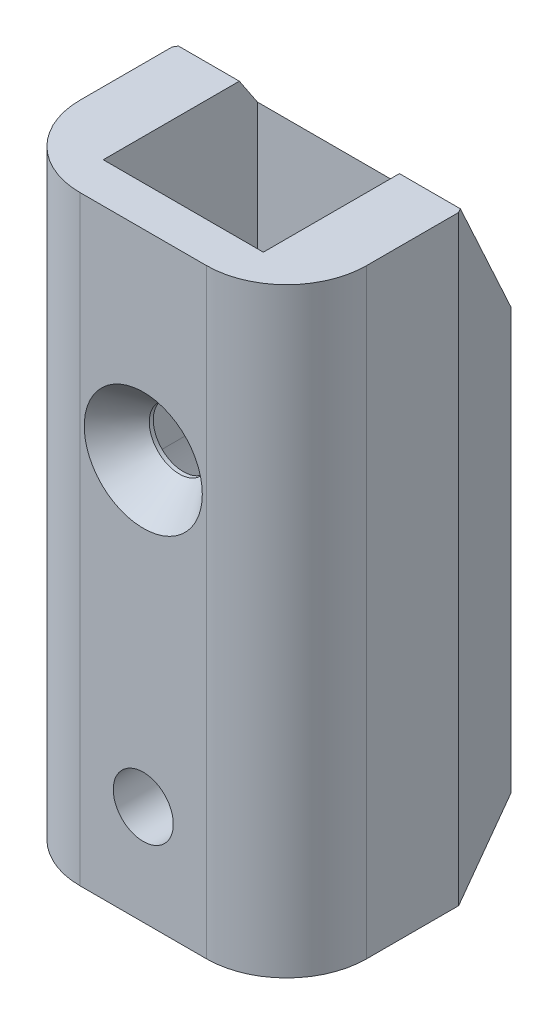
ISO-10303-21;
HEADER;
FILE_DESCRIPTION(('STEP AP214'),'2;1');
FILE_NAME('part.step','',(''),(''),'','','');
FILE_SCHEMA(('AUTOMOTIVE_DESIGN { 1 0 10303 214 1 1 1 1 }'));
ENDSEC;
DATA;
#1=APPLICATION_CONTEXT('core data for automotive mechanical design processes');
#2=APPLICATION_PROTOCOL_DEFINITION('international standard','automotive_design',2000,#1);
#3=PRODUCT_CONTEXT('',#1,'mechanical');
#4=PRODUCT('Part','Part','',(#3));
#5=PRODUCT_RELATED_PRODUCT_CATEGORY('part','',(#4));
#6=PRODUCT_DEFINITION_FORMATION('','',#4);
#7=PRODUCT_DEFINITION_CONTEXT('part definition',#1,'design');
#8=PRODUCT_DEFINITION('design','',#6,#7);
#9=PRODUCT_DEFINITION_SHAPE('','',#8);
#10=(LENGTH_UNIT() NAMED_UNIT(*) SI_UNIT(.MILLI.,.METRE.));
#11=(NAMED_UNIT(*) PLANE_ANGLE_UNIT() SI_UNIT($,.RADIAN.));
#12=(NAMED_UNIT(*) SI_UNIT($,.STERADIAN.) SOLID_ANGLE_UNIT());
#13=UNCERTAINTY_MEASURE_WITH_UNIT(LENGTH_MEASURE(1.E-05),#10,'distance_accuracy_value','');
#14=(GEOMETRIC_REPRESENTATION_CONTEXT(3) GLOBAL_UNCERTAINTY_ASSIGNED_CONTEXT((#13)) GLOBAL_UNIT_ASSIGNED_CONTEXT((#10,
#11,#12)) REPRESENTATION_CONTEXT('',''));
#15=CARTESIAN_POINT('',(0.,0.,0.));
#16=DIRECTION('',(0.,0.,1.));
#17=DIRECTION('',(1.,0.,0.));
#18=AXIS2_PLACEMENT_3D('',#15,#16,#17);
#19=CARTESIAN_POINT('',(3.57957166897568,-10.,-6.2));
#20=DIRECTION('',(0.,0.,-1.));
#21=DIRECTION('',(-1.,0.,0.));
#22=AXIS2_PLACEMENT_3D('',#19,#20,#21);
#23=PLANE('',#22);
#24=CARTESIAN_POINT('',(0.,6.,-6.2));
#25=DIRECTION('',(0.,0.,-1.));
#26=DIRECTION('',(-1.,0.,0.));
#27=AXIS2_PLACEMENT_3D('',#24,#25,#26);
#28=CIRCLE('',#27,3.29999999999999);
#29=CARTESIAN_POINT('',(-3.29999999999999,6.,-6.2));
#30=VERTEX_POINT('',#29);
#31=EDGE_CURVE('E302',#30,#30,#28,.F.);
#32=ORIENTED_EDGE('',*,*,#31,.T.);
#33=EDGE_LOOP('',(#32));
#34=FACE_BOUND('',#33,.T.);
#35=CARTESIAN_POINT('',(0.,-5.,-6.2));
#36=DIRECTION('',(0.,0.,-1.));
#37=DIRECTION('',(-1.,0.,0.));
#38=AXIS2_PLACEMENT_3D('',#35,#36,#37);
#39=CIRCLE('',#38,1.5);
#40=CARTESIAN_POINT('',(-1.5,-5.,-6.2));
#41=VERTEX_POINT('',#40);
#42=EDGE_CURVE('E344',#41,#41,#39,.T.);
#43=ORIENTED_EDGE('',*,*,#42,.F.);
#44=EDGE_LOOP('',(#43));
#45=FACE_BOUND('',#44,.T.);
#46=DIRECTION('',(0.,1.,0.));
#47=VECTOR('',#46,1.);
#48=CARTESIAN_POINT('',(-3.57957166897568,-10.,-6.2));
#49=LINE('',#48,#47);
#50=CARTESIAN_POINT('',(-3.57957166897568,-10.,-6.2));
#51=VERTEX_POINT('',#50);
#52=CARTESIAN_POINT('',(-3.57957166897567,11.,-6.2));
#53=VERTEX_POINT('',#52);
#54=EDGE_CURVE('E292',#51,#53,#49,.T.);
#55=ORIENTED_EDGE('',*,*,#54,.T.);
#56=DIRECTION('',(-1.,0.,0.));
#57=VECTOR('',#56,1.);
#58=CARTESIAN_POINT('',(7.15914333795136,11.,-6.2));
#59=LINE('',#58,#57);
#60=CARTESIAN_POINT('',(3.57957166897568,11.,-6.2));
#61=VERTEX_POINT('',#60);
#62=EDGE_CURVE('E338',#61,#53,#59,.T.);
#63=ORIENTED_EDGE('',*,*,#62,.F.);
#64=DIRECTION('',(0.,1.,0.));
#65=VECTOR('',#64,1.);
#66=CARTESIAN_POINT('',(3.57957166897568,-10.,-6.2));
#67=LINE('',#66,#65);
#68=CARTESIAN_POINT('',(3.57957166897568,-10.,-6.2));
#69=VERTEX_POINT('',#68);
#70=EDGE_CURVE('E182',#69,#61,#67,.T.);
#71=ORIENTED_EDGE('',*,*,#70,.F.);
#72=DIRECTION('',(-1.,0.,0.));
#73=VECTOR('',#72,1.);
#74=CARTESIAN_POINT('',(3.57957166897568,-10.,-6.2));
#75=LINE('',#74,#73);
#76=EDGE_CURVE('E281',#69,#51,#75,.T.);
#77=ORIENTED_EDGE('',*,*,#76,.T.);
#78=EDGE_LOOP('',(#55,#63,#71,#77));
#79=FACE_BOUND('',#78,.T.);
#80=ADVANCED_FACE('F39',(#34,#45,#79),#23,.T.);
#81=CARTESIAN_POINT('',(0.,20.,33.1970187895471));
#82=DIRECTION('',(0.,-1.,0.));
#83=DIRECTION('',(0.,0.,-1.));
#84=AXIS2_PLACEMENT_3D('',#81,#82,#83);
#85=PLANE('',#84);
#86=DIRECTION('',(-1.,0.,0.));
#87=VECTOR('',#86,1.);
#88=CARTESIAN_POINT('',(7.15914333795136,20.,-0.199999999999981));
#89=LINE('',#88,#87);
#90=CARTESIAN_POINT('',(-4.,20.,-0.199999999999981));
#91=VERTEX_POINT('',#90);
#92=CARTESIAN_POINT('',(-7.04367328411344,20.,-0.19999999999998));
#93=VERTEX_POINT('',#92);
#94=EDGE_CURVE('E173',#91,#93,#89,.T.);
#95=ORIENTED_EDGE('',*,*,#94,.T.);
#96=DIRECTION('',(0.500000000000001,0.,-0.866025403784438));
#97=VECTOR('',#96,1.);
#98=CARTESIAN_POINT('',(-5.36935750346351,20.,-3.1));
#99=LINE('',#98,#97);
#100=CARTESIAN_POINT('',(-7.15914333795136,20.,0.));
#101=VERTEX_POINT('',#100);
#102=EDGE_CURVE('E190',#101,#93,#99,.T.);
#103=ORIENTED_EDGE('',*,*,#102,.F.);
#104=DIRECTION('',(0.,0.,-1.));
#105=VECTOR('',#104,1.);
#106=CARTESIAN_POINT('',(-7.15914333795136,20.,33.1970187895471));
#107=LINE('',#106,#105);
#108=CARTESIAN_POINT('',(-7.15914333795136,20.,4.6));
#109=VERTEX_POINT('',#108);
#110=EDGE_CURVE('E267',#109,#101,#107,.T.);
#111=ORIENTED_EDGE('',*,*,#110,.F.);
#112=CARTESIAN_POINT('',(-3.15914333795136,20.,4.6));
#113=DIRECTION('',(0.,-1.,0.));
#114=DIRECTION('',(0.,0.,-1.));
#115=AXIS2_PLACEMENT_3D('',#112,#113,#114);
#116=CIRCLE('',#115,4.);
#117=CARTESIAN_POINT('',(-3.15914333795136,20.,8.6));
#118=VERTEX_POINT('',#117);
#119=EDGE_CURVE('E313',#109,#118,#116,.F.);
#120=ORIENTED_EDGE('',*,*,#119,.T.);
#121=DIRECTION('',(-1.,0.,0.));
#122=VECTOR('',#121,1.);
#123=CARTESIAN_POINT('',(0.,20.,8.6));
#124=LINE('',#123,#122);
#125=CARTESIAN_POINT('',(3.15914333795136,20.,8.6));
#126=VERTEX_POINT('',#125);
#127=EDGE_CURVE('E256',#126,#118,#124,.T.);
#128=ORIENTED_EDGE('',*,*,#127,.F.);
#129=CARTESIAN_POINT('',(3.15914333795136,20.,4.6));
#130=DIRECTION('',(0.,-1.,0.));
#131=DIRECTION('',(0.,0.,-1.));
#132=AXIS2_PLACEMENT_3D('',#129,#130,#131);
#133=CIRCLE('',#132,4.);
#134=CARTESIAN_POINT('',(7.15914333795136,20.,4.6));
#135=VERTEX_POINT('',#134);
#136=EDGE_CURVE('E315',#126,#135,#133,.F.);
#137=ORIENTED_EDGE('',*,*,#136,.T.);
#138=DIRECTION('',(0.,0.,-1.));
#139=VECTOR('',#138,1.);
#140=CARTESIAN_POINT('',(7.15914333795136,20.,33.1970187895471));
#141=LINE('',#140,#139);
#142=CARTESIAN_POINT('',(7.15914333795136,20.,0.));
#143=VERTEX_POINT('',#142);
#144=EDGE_CURVE('E188',#135,#143,#141,.T.);
#145=ORIENTED_EDGE('',*,*,#144,.T.);
#146=DIRECTION('',(0.499999999999995,0.,0.866025403784442));
#147=VECTOR('',#146,1.);
#148=CARTESIAN_POINT('',(5.36935750346353,20.,-3.09999999999997));
#149=LINE('',#148,#147);
#150=CARTESIAN_POINT('',(7.04367328411344,20.,-0.199999999999982));
#151=VERTEX_POINT('',#150);
#152=EDGE_CURVE('E179',#151,#143,#149,.T.);
#153=ORIENTED_EDGE('',*,*,#152,.F.);
#154=CARTESIAN_POINT('',(4.,20.,-0.199999999999981));
#155=VERTEX_POINT('',#154);
#156=EDGE_CURVE('E162',#151,#155,#89,.T.);
#157=ORIENTED_EDGE('',*,*,#156,.T.);
#158=DIRECTION('',(0.,0.,-1.));
#159=VECTOR('',#158,1.);
#160=CARTESIAN_POINT('',(4.,20.,33.1970187895471));
#161=LINE('',#160,#159);
#162=CARTESIAN_POINT('',(4.,20.,6.6));
#163=VERTEX_POINT('',#162);
#164=EDGE_CURVE('E259',#163,#155,#161,.T.);
#165=ORIENTED_EDGE('',*,*,#164,.F.);
#166=DIRECTION('',(1.,0.,0.));
#167=VECTOR('',#166,1.);
#168=CARTESIAN_POINT('',(0.,20.,6.6));
#169=LINE('',#168,#167);
#170=CARTESIAN_POINT('',(-4.,20.,6.6));
#171=VERTEX_POINT('',#170);
#172=EDGE_CURVE('E250',#171,#163,#169,.T.);
#173=ORIENTED_EDGE('',*,*,#172,.F.);
#174=DIRECTION('',(0.,0.,-1.));
#175=VECTOR('',#174,1.);
#176=CARTESIAN_POINT('',(-4.,20.,33.1970187895471));
#177=LINE('',#176,#175);
#178=EDGE_CURVE('E264',#171,#91,#177,.T.);
#179=ORIENTED_EDGE('',*,*,#178,.T.);
#180=EDGE_LOOP('',(#95,#103,#111,#120,#128,#137,#145,#153,#157,#165,#173,#179));
#181=FACE_BOUND('',#180,.T.);
#182=ADVANCED_FACE('F186',(#181),#85,.F.);
#183=CARTESIAN_POINT('',(-4.,0.,33.1970187895471));
#184=DIRECTION('',(-1.,0.,0.));
#185=DIRECTION('',(0.,0.,1.));
#186=AXIS2_PLACEMENT_3D('',#183,#184,#185);
#187=PLANE('',#186);
#188=DIRECTION('',(0.,-0.832050294337843,-0.55470019622523));
#189=VECTOR('',#188,1.);
#190=CARTESIAN_POINT('',(-4.,21.5678548259449,0.84523655062993));
#191=LINE('',#190,#189);
#192=CARTESIAN_POINT('',(-4.,18.65,-1.1));
#193=VERTEX_POINT('',#192);
#194=EDGE_CURVE('E54',#91,#193,#191,.T.);
#195=ORIENTED_EDGE('',*,*,#194,.F.);
#196=ORIENTED_EDGE('',*,*,#178,.F.);
#197=DIRECTION('',(0.,1.,0.));
#198=VECTOR('',#197,1.);
#199=CARTESIAN_POINT('',(-4.,0.,6.6));
#200=LINE('',#199,#198);
#201=CARTESIAN_POINT('',(-4.,6.,6.6));
#202=VERTEX_POINT('',#201);
#203=EDGE_CURVE('E243',#202,#171,#200,.T.);
#204=ORIENTED_EDGE('',*,*,#203,.F.);
#205=DIRECTION('',(0.,0.,-1.));
#206=VECTOR('',#205,1.);
#207=CARTESIAN_POINT('',(-4.,6.,33.1970187895471));
#208=LINE('',#207,#206);
#209=CARTESIAN_POINT('',(-4.,6.,-1.1));
#210=VERTEX_POINT('',#209);
#211=EDGE_CURVE('E260',#202,#210,#208,.T.);
#212=ORIENTED_EDGE('',*,*,#211,.T.);
#213=DIRECTION('',(0.,1.,0.));
#214=VECTOR('',#213,1.);
#215=CARTESIAN_POINT('',(-4.,0.,-1.1));
#216=LINE('',#215,#214);
#217=EDGE_CURVE('E212',#210,#193,#216,.T.);
#218=ORIENTED_EDGE('',*,*,#217,.T.);
#219=EDGE_LOOP('',(#195,#196,#204,#212,#218));
#220=FACE_BOUND('',#219,.T.);
#221=ADVANCED_FACE('F416',(#220),#187,.F.);
#222=CARTESIAN_POINT('',(4.,0.,33.1970187895471));
#223=DIRECTION('',(-1.,0.,0.));
#224=DIRECTION('',(0.,0.,1.));
#225=AXIS2_PLACEMENT_3D('',#222,#223,#224);
#226=PLANE('',#225);
#227=ORIENTED_EDGE('',*,*,#164,.T.);
#228=DIRECTION('',(0.,-0.832050294337843,-0.55470019622523));
#229=VECTOR('',#228,1.);
#230=CARTESIAN_POINT('',(4.,21.5678548259449,0.84523655062993));
#231=LINE('',#230,#229);
#232=CARTESIAN_POINT('',(4.,18.65,-1.1));
#233=VERTEX_POINT('',#232);
#234=EDGE_CURVE('E168',#155,#233,#231,.T.);
#235=ORIENTED_EDGE('',*,*,#234,.T.);
#236=DIRECTION('',(0.,1.,0.));
#237=VECTOR('',#236,1.);
#238=CARTESIAN_POINT('',(4.,0.,-1.1));
#239=LINE('',#238,#237);
#240=CARTESIAN_POINT('',(4.,6.,-1.1));
#241=VERTEX_POINT('',#240);
#242=EDGE_CURVE('E217',#241,#233,#239,.T.);
#243=ORIENTED_EDGE('',*,*,#242,.F.);
#244=DIRECTION('',(0.,0.,-1.));
#245=VECTOR('',#244,1.);
#246=CARTESIAN_POINT('',(4.,6.,33.1970187895471));
#247=LINE('',#246,#245);
#248=CARTESIAN_POINT('',(4.,6.,6.6));
#249=VERTEX_POINT('',#248);
#250=EDGE_CURVE('E263',#249,#241,#247,.T.);
#251=ORIENTED_EDGE('',*,*,#250,.F.);
#252=DIRECTION('',(0.,1.,0.));
#253=VECTOR('',#252,1.);
#254=CARTESIAN_POINT('',(4.,0.,6.6));
#255=LINE('',#254,#253);
#256=EDGE_CURVE('E248',#249,#163,#255,.T.);
#257=ORIENTED_EDGE('',*,*,#256,.T.);
#258=EDGE_LOOP('',(#227,#235,#243,#251,#257));
#259=FACE_BOUND('',#258,.T.);
#260=ADVANCED_FACE('F419',(#259),#226,.T.);
#261=CARTESIAN_POINT('',(-3.57957166897568,-10.,-6.2));
#262=DIRECTION('',(-0.866025403784439,0.,-0.5));
#263=DIRECTION('',(-0.5,0.,0.866025403784439));
#264=AXIS2_PLACEMENT_3D('',#261,#262,#263);
#265=PLANE('',#264);
#266=ORIENTED_EDGE('',*,*,#102,.T.);
#267=DIRECTION('',(0.30499714066521,-0.792405815693061,-0.528270543795375));
#268=VECTOR('',#267,1.);
#269=CARTESIAN_POINT('',(1.49573999971453,-2.18604651162787,-14.9906976744186));
#270=LINE('',#269,#268);
#271=EDGE_CURVE('E183',#93,#53,#270,.T.);
#272=ORIENTED_EDGE('',*,*,#271,.T.);
#273=ORIENTED_EDGE('',*,*,#54,.F.);
#274=DIRECTION('',(-0.5,0.,0.866025403784438));
#275=VECTOR('',#274,1.);
#276=CARTESIAN_POINT('',(-3.57957166897568,-10.,-6.2));
#277=LINE('',#276,#275);
#278=CARTESIAN_POINT('',(-7.15914333795136,-10.,0.));
#279=VERTEX_POINT('',#278);
#280=EDGE_CURVE('E284',#51,#279,#277,.T.);
#281=ORIENTED_EDGE('',*,*,#280,.T.);
#282=DIRECTION('',(0.,1.,0.));
#283=VECTOR('',#282,1.);
#284=CARTESIAN_POINT('',(-7.15914333795136,-10.,0.));
#285=LINE('',#284,#283);
#286=EDGE_CURVE('E288',#279,#101,#285,.T.);
#287=ORIENTED_EDGE('',*,*,#286,.T.);
#288=EDGE_LOOP('',(#266,#272,#273,#281,#287));
#289=FACE_BOUND('',#288,.T.);
#290=ADVANCED_FACE('F332',(#289),#265,.T.);
#291=CARTESIAN_POINT('',(7.15914333795136,-10.,0.));
#292=DIRECTION('',(0.866025403784439,0.,-0.5));
#293=DIRECTION('',(-0.5,0.,-0.866025403784439));
#294=AXIS2_PLACEMENT_3D('',#291,#292,#293);
#295=PLANE('',#294);
#296=ORIENTED_EDGE('',*,*,#70,.T.);
#297=DIRECTION('',(0.30499714066521,0.792405815693061,0.528270543795375));
#298=VECTOR('',#297,1.);
#299=CARTESIAN_POINT('',(-0.163806355444502,1.2744186046512,-12.6837209302326));
#300=LINE('',#299,#298);
#301=EDGE_CURVE('E165',#61,#151,#300,.T.);
#302=ORIENTED_EDGE('',*,*,#301,.T.);
#303=ORIENTED_EDGE('',*,*,#152,.T.);
#304=DIRECTION('',(0.,1.,0.));
#305=VECTOR('',#304,1.);
#306=CARTESIAN_POINT('',(7.15914333795136,-10.,0.));
#307=LINE('',#306,#305);
#308=CARTESIAN_POINT('',(7.15914333795136,-10.,0.));
#309=VERTEX_POINT('',#308);
#310=EDGE_CURVE('E287',#309,#143,#307,.T.);
#311=ORIENTED_EDGE('',*,*,#310,.F.);
#312=DIRECTION('',(-0.5,0.,-0.866025403784439));
#313=VECTOR('',#312,1.);
#314=CARTESIAN_POINT('',(7.15914333795136,-10.,0.));
#315=LINE('',#314,#313);
#316=EDGE_CURVE('E277',#309,#69,#315,.T.);
#317=ORIENTED_EDGE('',*,*,#316,.T.);
#318=EDGE_LOOP('',(#296,#302,#303,#311,#317));
#319=FACE_BOUND('',#318,.T.);
#320=ADVANCED_FACE('F177',(#319),#295,.T.);
#321=CARTESIAN_POINT('',(0.,0.,-1.1));
#322=DIRECTION('',(0.,0.,1.));
#323=DIRECTION('',(1.,0.,0.));
#324=AXIS2_PLACEMENT_3D('',#321,#322,#323);
#325=PLANE('',#324);
#326=CARTESIAN_POINT('',(0.,10.,-1.1));
#327=DIRECTION('',(0.,0.,1.));
#328=DIRECTION('',(1.,0.,0.));
#329=AXIS2_PLACEMENT_3D('',#326,#327,#328);
#330=CIRCLE('',#329,3.2);
#331=CARTESIAN_POINT('',(3.2,10.,-1.1));
#332=VERTEX_POINT('',#331);
#333=CARTESIAN_POINT('',(-3.2,10.,-1.1));
#334=VERTEX_POINT('',#333);
#335=EDGE_CURVE('E194',#332,#334,#330,.T.);
#336=ORIENTED_EDGE('',*,*,#335,.F.);
#337=DIRECTION('',(0.,1.,0.));
#338=VECTOR('',#337,1.);
#339=CARTESIAN_POINT('',(3.2,0.,-1.1));
#340=LINE('',#339,#338);
#341=CARTESIAN_POINT('',(3.2,6.,-1.1));
#342=VERTEX_POINT('',#341);
#343=EDGE_CURVE('E203',#342,#332,#340,.T.);
#344=ORIENTED_EDGE('',*,*,#343,.F.);
#345=CARTESIAN_POINT('',(0.,6.,-1.1));
#346=DIRECTION('',(0.,0.,1.));
#347=DIRECTION('',(1.,0.,0.));
#348=AXIS2_PLACEMENT_3D('',#345,#346,#347);
#349=CIRCLE('',#348,3.2);
#350=CARTESIAN_POINT('',(-3.2,6.,-1.1));
#351=VERTEX_POINT('',#350);
#352=EDGE_CURVE('E206',#351,#342,#349,.T.);
#353=ORIENTED_EDGE('',*,*,#352,.F.);
#354=DIRECTION('',(0.,1.,0.));
#355=VECTOR('',#354,1.);
#356=CARTESIAN_POINT('',(-3.2,0.,-1.1));
#357=LINE('',#356,#355);
#358=EDGE_CURVE('E209',#351,#334,#357,.T.);
#359=ORIENTED_EDGE('',*,*,#358,.T.);
#360=EDGE_LOOP('',(#336,#344,#353,#359));
#361=FACE_BOUND('',#360,.T.);
#362=ORIENTED_EDGE('',*,*,#242,.T.);
#363=DIRECTION('',(-1.,0.,0.));
#364=VECTOR('',#363,1.);
#365=CARTESIAN_POINT('',(0.,18.65,-1.1));
#366=LINE('',#365,#364);
#367=EDGE_CURVE('E11',#233,#193,#366,.T.);
#368=ORIENTED_EDGE('',*,*,#367,.T.);
#369=ORIENTED_EDGE('',*,*,#217,.F.);
#370=CARTESIAN_POINT('',(0.,6.,-1.1));
#371=DIRECTION('',(0.,0.,1.));
#372=DIRECTION('',(1.,0.,0.));
#373=AXIS2_PLACEMENT_3D('',#370,#371,#372);
#374=CIRCLE('',#373,4.);
#375=EDGE_CURVE('E215',#210,#241,#374,.T.);
#376=ORIENTED_EDGE('',*,*,#375,.T.);
#377=EDGE_LOOP('',(#362,#368,#369,#376));
#378=FACE_BOUND('',#377,.T.);
#379=ADVANCED_FACE('F374',(#361,#378),#325,.T.);
#380=CARTESIAN_POINT('',(-7.15914333795136,0.,33.1970187895471));
#381=DIRECTION('',(-1.,0.,0.));
#382=DIRECTION('',(0.,0.,1.));
#383=AXIS2_PLACEMENT_3D('',#380,#381,#382);
#384=PLANE('',#383);
#385=DIRECTION('',(0.,0.,-1.));
#386=VECTOR('',#385,1.);
#387=CARTESIAN_POINT('',(-7.15914333795136,-10.,0.));
#388=LINE('',#387,#386);
#389=CARTESIAN_POINT('',(-7.15914333795136,-10.,4.6));
#390=VERTEX_POINT('',#389);
#391=EDGE_CURVE('E197',#390,#279,#388,.T.);
#392=ORIENTED_EDGE('',*,*,#391,.F.);
#393=DIRECTION('',(0.,1.,0.));
#394=VECTOR('',#393,1.);
#395=CARTESIAN_POINT('',(-7.15914333795136,0.,4.6));
#396=LINE('',#395,#394);
#397=EDGE_CURVE('E47',#390,#109,#396,.T.);
#398=ORIENTED_EDGE('',*,*,#397,.T.);
#399=ORIENTED_EDGE('',*,*,#110,.T.);
#400=ORIENTED_EDGE('',*,*,#286,.F.);
#401=EDGE_LOOP('',(#392,#398,#399,#400));
#402=FACE_BOUND('',#401,.T.);
#403=ADVANCED_FACE('F325',(#402),#384,.T.);
#404=CARTESIAN_POINT('',(7.15914333795136,0.,33.1970187895471));
#405=DIRECTION('',(-1.,0.,0.));
#406=DIRECTION('',(0.,0.,1.));
#407=AXIS2_PLACEMENT_3D('',#404,#405,#406);
#408=PLANE('',#407);
#409=ORIENTED_EDGE('',*,*,#144,.F.);
#410=DIRECTION('',(0.,1.,0.));
#411=VECTOR('',#410,1.);
#412=CARTESIAN_POINT('',(7.15914333795136,-10.,4.6));
#413=LINE('',#412,#411);
#414=CARTESIAN_POINT('',(7.15914333795136,-10.,4.6));
#415=VERTEX_POINT('',#414);
#416=EDGE_CURVE('E317',#135,#415,#413,.F.);
#417=ORIENTED_EDGE('',*,*,#416,.T.);
#418=DIRECTION('',(0.,0.,1.));
#419=VECTOR('',#418,1.);
#420=CARTESIAN_POINT('',(7.15914333795136,-10.,0.));
#421=LINE('',#420,#419);
#422=EDGE_CURVE('E191',#309,#415,#421,.T.);
#423=ORIENTED_EDGE('',*,*,#422,.F.);
#424=ORIENTED_EDGE('',*,*,#310,.T.);
#425=EDGE_LOOP('',(#409,#417,#423,#424));
#426=FACE_BOUND('',#425,.T.);
#427=ADVANCED_FACE('F414',(#426),#408,.F.);
#428=CARTESIAN_POINT('',(0.,6.,33.1970187895471));
#429=DIRECTION('',(0.,0.,-1.));
#430=DIRECTION('',(-1.,0.,0.));
#431=AXIS2_PLACEMENT_3D('',#428,#429,#430);
#432=CYLINDRICAL_SURFACE('',#431,4.);
#433=ORIENTED_EDGE('',*,*,#375,.F.);
#434=ORIENTED_EDGE('',*,*,#211,.F.);
#435=CARTESIAN_POINT('',(0.,6.,6.6));
#436=DIRECTION('',(0.,0.,1.));
#437=DIRECTION('',(1.,0.,0.));
#438=AXIS2_PLACEMENT_3D('',#435,#436,#437);
#439=CIRCLE('',#438,4.);
#440=EDGE_CURVE('E246',#202,#249,#439,.T.);
#441=ORIENTED_EDGE('',*,*,#440,.T.);
#442=ORIENTED_EDGE('',*,*,#250,.T.);
#443=EDGE_LOOP('',(#433,#434,#441,#442));
#444=FACE_BOUND('',#443,.T.);
#445=ADVANCED_FACE('F411',(#444),#432,.F.);
#446=CARTESIAN_POINT('',(0.,-10.,0.));
#447=DIRECTION('',(0.,1.,0.));
#448=DIRECTION('',(0.,0.,1.));
#449=AXIS2_PLACEMENT_3D('',#446,#447,#448);
#450=PLANE('',#449);
#451=CARTESIAN_POINT('',(0.,-10.,0.));
#452=DIRECTION('',(0.,1.,0.));
#453=DIRECTION('',(0.,0.,1.));
#454=AXIS2_PLACEMENT_3D('',#451,#452,#453);
#455=CIRCLE('',#454,5.);
#456=CARTESIAN_POINT('',(0.,-10.,5.));
#457=VERTEX_POINT('',#456);
#458=EDGE_CURVE('E274',#457,#457,#455,.T.);
#459=ORIENTED_EDGE('',*,*,#458,.T.);
#460=EDGE_LOOP('',(#459));
#461=FACE_BOUND('',#460,.T.);
#462=ORIENTED_EDGE('',*,*,#422,.T.);
#463=CARTESIAN_POINT('',(3.15914333795136,-10.,4.6));
#464=DIRECTION('',(0.,1.,0.));
#465=DIRECTION('',(0.,0.,1.));
#466=AXIS2_PLACEMENT_3D('',#463,#464,#465);
#467=CIRCLE('',#466,4.);
#468=CARTESIAN_POINT('',(3.15914333795136,-10.,8.6));
#469=VERTEX_POINT('',#468);
#470=EDGE_CURVE('E320',#415,#469,#467,.F.);
#471=ORIENTED_EDGE('',*,*,#470,.T.);
#472=DIRECTION('',(-1.,0.,0.));
#473=VECTOR('',#472,1.);
#474=CARTESIAN_POINT('',(0.,-10.,8.6));
#475=LINE('',#474,#473);
#476=CARTESIAN_POINT('',(-3.15914333795136,-10.,8.6));
#477=VERTEX_POINT('',#476);
#478=EDGE_CURVE('E474',#469,#477,#475,.T.);
#479=ORIENTED_EDGE('',*,*,#478,.T.);
#480=CARTESIAN_POINT('',(-3.15914333795136,-10.,4.6));
#481=DIRECTION('',(0.,1.,0.));
#482=DIRECTION('',(0.,0.,1.));
#483=AXIS2_PLACEMENT_3D('',#480,#481,#482);
#484=CIRCLE('',#483,4.);
#485=EDGE_CURVE('E61',#477,#390,#484,.F.);
#486=ORIENTED_EDGE('',*,*,#485,.T.);
#487=ORIENTED_EDGE('',*,*,#391,.T.);
#488=ORIENTED_EDGE('',*,*,#280,.F.);
#489=ORIENTED_EDGE('',*,*,#76,.F.);
#490=ORIENTED_EDGE('',*,*,#316,.F.);
#491=EDGE_LOOP('',(#462,#471,#479,#486,#487,#488,#489,#490));
#492=FACE_BOUND('',#491,.T.);
#493=ADVANCED_FACE('F335',(#461,#492),#450,.F.);
#494=CARTESIAN_POINT('',(0.,-10.,0.));
#495=DIRECTION('',(0.,1.,0.));
#496=DIRECTION('',(0.,0.,1.));
#497=AXIS2_PLACEMENT_3D('',#494,#495,#496);
#498=CYLINDRICAL_SURFACE('',#497,5.);
#499=CARTESIAN_POINT('',(0.,-6.5,5.));
#500=CARTESIAN_POINT('',(0.0822886127532999,-6.49999900251511,4.9999992925055));
#501=CARTESIAN_POINT('',(0.164587318351529,-6.49320613637603,4.99794915693953));
#502=CARTESIAN_POINT('',(0.326788125304881,-6.4662786457779,4.98997105593691));
#503=CARTESIAN_POINT('',(0.40668950441142,-6.44614004197666,4.98404193389692));
#504=CARTESIAN_POINT('',(0.561732707754527,-6.39325398308974,4.96895552501836));
#505=CARTESIAN_POINT('',(0.636881364395373,-6.36052513038106,4.95980300250425));
#506=CARTESIAN_POINT('',(0.780624181053131,-6.28346390694416,4.93922109237645));
#507=CARTESIAN_POINT('',(0.849217467469669,-6.23912999260458,4.92779140192067));
#508=CARTESIAN_POINT('',(0.979871797183745,-6.13877599252733,4.90350737192774));
#509=CARTESIAN_POINT('',(1.04171807124434,-6.08248337411409,4.89062383657036));
#510=CARTESIAN_POINT('',(1.15524920923324,-5.96039077008982,4.86505834210442));
#511=CARTESIAN_POINT('',(1.20693236327441,-5.89458918787504,4.85237641724501));
#512=CARTESIAN_POINT('',(1.29980037723708,-5.75352924696239,4.82834113993772));
#513=CARTESIAN_POINT('',(1.34072309022213,-5.67809153900926,4.81702406663875));
#514=CARTESIAN_POINT('',(1.4092139477476,-5.52101074576971,4.79743620394031));
#515=CARTESIAN_POINT('',(1.43678529919973,-5.43936915607203,4.78916468313311));
#516=CARTESIAN_POINT('',(1.47701633682652,-5.27460973386954,4.77690870838434));
#517=CARTESIAN_POINT('',(1.49007196234677,-5.19159725613606,4.77281069324533));
#518=CARTESIAN_POINT('',(1.50213730614672,-5.02446684378323,4.76902789749767));
#519=CARTESIAN_POINT('',(1.50115042761078,-4.94034918194091,4.76934204760571));
#520=CARTESIAN_POINT('',(1.48546977199812,-4.77661609139152,4.77424744067778));
#521=CARTESIAN_POINT('',(1.47127205262685,-4.69694774963776,4.7786838859914));
#522=CARTESIAN_POINT('',(1.43037420427056,-4.54118021372654,4.79108356228624));
#523=CARTESIAN_POINT('',(1.40367284141641,-4.46508137262567,4.7990471413235));
#524=CARTESIAN_POINT('',(1.33816026653682,-4.31739965033926,4.81772733074973));
#525=CARTESIAN_POINT('',(1.29918816934642,-4.24589291604474,4.82848016115952));
#526=CARTESIAN_POINT('',(1.21035222588683,-4.11026797798981,4.85150987000064));
#527=CARTESIAN_POINT('',(1.16048574002588,-4.04615157058622,4.86378711746991));
#528=CARTESIAN_POINT('',(1.04881290765546,-3.92431380923798,4.88911011297937));
#529=CARTESIAN_POINT('',(0.986594907466972,-3.86697133597033,4.90216654310498));
#530=CARTESIAN_POINT('',(0.853263259313967,-3.76344601593575,4.92712244063258));
#531=CARTESIAN_POINT('',(0.782149051860888,-3.71726387158557,4.9390218351841));
#532=CARTESIAN_POINT('',(0.632355038342803,-3.63714007753527,4.9604316006947));
#533=CARTESIAN_POINT('',(0.55362774974795,-3.60328248375014,4.96992543668314));
#534=CARTESIAN_POINT('',(0.391245415603519,-3.54940040990037,4.98533521832222));
#535=CARTESIAN_POINT('',(0.307591751589582,-3.52937207146751,4.99125216186999));
#536=CARTESIAN_POINT('',(0.140952242668332,-3.50434782210061,4.99868364643538));
#537=CARTESIAN_POINT('',(0.058050097601187,-3.49883841419839,5.0003485041779));
#538=CARTESIAN_POINT('',(-0.107499605823383,-3.50156915571208,4.99952923241759));
#539=CARTESIAN_POINT('',(-0.19014719669078,-3.50980746965144,4.99704565677756));
#540=CARTESIAN_POINT('',(-0.350903605309697,-3.5393846111115,4.98830696987163));
#541=CARTESIAN_POINT('',(-0.429072772614169,-3.56042338758087,4.98213829799417));
#542=CARTESIAN_POINT('',(-0.580754638954522,-3.6146432327782,4.96674347841532));
#543=CARTESIAN_POINT('',(-0.654266777025583,-3.64782576103786,4.95751696321085));
#544=CARTESIAN_POINT('',(-0.796437189461052,-3.72625316548113,4.93669654351325));
#545=CARTESIAN_POINT('',(-0.864943826199669,-3.77175934094797,4.92505280829675));
#546=CARTESIAN_POINT('',(-0.993523307980147,-3.87322475405281,4.90073468764317));
#547=CARTESIAN_POINT('',(-1.05359403235593,-3.92918661188767,4.8880600443108));
#548=CARTESIAN_POINT('',(-1.16585744551027,-4.05238730836935,4.86253171869138));
#549=CARTESIAN_POINT('',(-1.21768481231503,-4.11996187577174,4.84968825033268));
#550=CARTESIAN_POINT('',(-1.30928995072154,-4.26312793901353,4.82576515238463));
#551=CARTESIAN_POINT('',(-1.34906803829472,-4.33871922455821,4.81468547654651));
#552=CARTESIAN_POINT('',(-1.41517347127168,-4.49553249125469,4.79567189615055));
#553=CARTESIAN_POINT('',(-1.4415634693705,-4.57672618653659,4.78772337843827));
#554=CARTESIAN_POINT('',(-1.48021730815114,-4.74268796893148,4.77591594362794));
#555=CARTESIAN_POINT('',(-1.49248598978779,-4.82745482078767,4.772055625083));
#556=CARTESIAN_POINT('',(-1.50221984485059,-4.99436151837623,4.76899972496087));
#557=CARTESIAN_POINT('',(-1.5002805530849,-5.07646365101758,4.76961647442754));
#558=CARTESIAN_POINT('',(-1.48307505444813,-5.2391141033728,4.77499401288294));
#559=CARTESIAN_POINT('',(-1.46780938124716,-5.31966248517635,4.77975463592551));
#560=CARTESIAN_POINT('',(-1.42476888804136,-5.47594539914285,4.79275763670385));
#561=CARTESIAN_POINT('',(-1.39715175507068,-5.55172728736169,4.80095604545965));
#562=CARTESIAN_POINT('',(-1.33031507121129,-5.69764243881772,4.81990278909136));
#563=CARTESIAN_POINT('',(-1.29109329962876,-5.76777461764076,4.83065161194312));
#564=CARTESIAN_POINT('',(-1.20048763805072,-5.90316311652711,4.85397676425833));
#565=CARTESIAN_POINT('',(-1.14871276092994,-5.96814876126041,4.86660540163797));
#566=CARTESIAN_POINT('',(-1.03517434629782,-6.08870249830786,4.89201320450026));
#567=CARTESIAN_POINT('',(-0.973408217134501,-6.14426813946776,4.90479240823905));
#568=CARTESIAN_POINT('',(-0.839465762183249,-6.24602341229503,4.92950936570649));
#569=CARTESIAN_POINT('',(-0.767037885790607,-6.29189144685549,4.94141159765674));
#570=CARTESIAN_POINT('',(-0.615141373983529,-6.37073516990402,4.96260680455813));
#571=CARTESIAN_POINT('',(-0.535676052998955,-6.40371688827451,4.97190099931066));
#572=CARTESIAN_POINT('',(-0.380757712655281,-6.45289527565275,4.98602174969301));
#573=CARTESIAN_POINT('',(-0.305786961954234,-6.47051167288325,4.99122027381067));
#574=CARTESIAN_POINT('',(-0.153880195230779,-6.49406352524158,4.99820944494492));
#575=CARTESIAN_POINT('',(-0.0769445098581395,-6.50000093270482,5.0000006615474));
#576=CARTESIAN_POINT('',(0.,-6.5,5.));
#577=B_SPLINE_CURVE_WITH_KNOTS('',3,(#499,#500,#501,#502,#503,#504,#505,#506,#507,#508,#509,
#510,#511,#512,#513,#514,#515,#516,#517,#518,#519,#520,#521,#522,#523,#524,#525,#526,#527,#528,
#529,#530,#531,#532,#533,#534,#535,#536,#537,#538,#539,#540,#541,#542,#543,#544,#545,#546,#547,
#548,#549,#550,#551,#552,#553,#554,#555,#556,#557,#558,#559,#560,#561,#562,#563,#564,#565,#566,
#567,#568,#569,#570,#571,#572,#573,#574,#575,#576),.UNSPECIFIED.,.T.,.F.,(4,2,2,2,2,2,2,2,2,2,2,
2,2,2,2,2,2,2,2,2,2,2,2,2,2,2,2,2,2,2,2,2,2,2,2,2,2,2,4),(0.,0.24658320361261,0.493239964846,
0.739533676300875,0.985860164412702,1.23855602948191,1.49129437288633,1.74971481004109,
2.00807314543224,2.25919689356599,2.51025978319089,2.75226016697676,2.99428443658001,
3.2396242644712,3.48502360158555,3.74067104048167,3.99633456531071,4.25371046881689,
4.51101453528808,4.75908809438545,5.00712853550327,5.24956746682327,5.49203554593728,
5.74011305702908,5.98825282000191,6.24540400322818,6.5025484425268,6.75847814951252,
7.01432009460283,7.25950155466943,7.504673196616,7.74680040402721,7.98897397553107,
8.23996925679931,8.49102974897502,8.74942996156671,9.00770911595235,9.2383169193046,
9.46888616948875),.UNSPECIFIED.);
#578=CARTESIAN_POINT('',(0.,-6.5,5.));
#579=VERTEX_POINT('',#578);
#580=EDGE_CURVE('E358',#579,#579,#577,.T.);
#581=ORIENTED_EDGE('',*,*,#580,.T.);
#582=EDGE_LOOP('',(#581));
#583=FACE_BOUND('',#582,.T.);
#584=CARTESIAN_POINT('',(-1.5,-5.,-4.76969600708473));
#585=CARTESIAN_POINT('',(-1.49999897633764,-4.9178054520576,-4.7696968572698));
#586=CARTESIAN_POINT('',(-1.49322108167142,-4.83560077585598,-4.77184390209069));
#587=CARTESIAN_POINT('',(-1.46635844446749,-4.67359475040806,-4.780165783029));
#588=CARTESIAN_POINT('',(-1.44626925573578,-4.59379421349854,-4.78634196493468));
#589=CARTESIAN_POINT('',(-1.39352753269955,-4.43896527172827,-4.80196102485632));
#590=CARTESIAN_POINT('',(-1.36089589394243,-4.36392917036691,-4.81139846703232));
#591=CARTESIAN_POINT('',(-1.28406421917929,-4.2203780660047,-4.83246932547567));
#592=CARTESIAN_POINT('',(-1.23986245137053,-4.15186404131556,-4.84410307041019));
#593=CARTESIAN_POINT('',(-1.13964754141627,-4.02113360942262,-4.86866862185765));
#594=CARTESIAN_POINT('',(-1.08333207175807,-3.95915410205371,-4.88162808311636));
#595=CARTESIAN_POINT('',(-0.961136237579598,-3.84536204867749,-4.90714861936757));
#596=CARTESIAN_POINT('',(-0.895254645461111,-3.79355080955012,-4.91970964297705));
#597=CARTESIAN_POINT('',(-0.75411143779369,-3.70053730016669,-4.94333214579389));
#598=CARTESIAN_POINT('',(-0.678684021335814,-3.65957657555719,-4.95435724342404));
#599=CARTESIAN_POINT('',(-0.521624645369353,-3.59101274095724,-4.97334435920684));
#600=CARTESIAN_POINT('',(-0.439994028387911,-3.56340675014255,-4.98130703789495));
#601=CARTESIAN_POINT('',(-0.275323852630829,-3.52311999890949,-4.99307646003589));
#602=CARTESIAN_POINT('',(-0.1923913989538,-3.5100348723473,-4.99699557369338));
#603=CARTESIAN_POINT('',(-0.0254218237493146,-3.49788267535356,-5.00063201501348));
#604=CARTESIAN_POINT('',(0.0586150620503686,-3.49881266059804,-5.00035022521079));
#605=CARTESIAN_POINT('',(0.222571156600161,-3.51439286854302,-4.99569603817658));
#606=CARTESIAN_POINT('',(0.302536267641342,-3.52860519380987,-4.9914542020526));
#607=CARTESIAN_POINT('',(0.458889213442527,-3.56963133599429,-4.97951522112593));
#608=CARTESIAN_POINT('',(0.535276821322846,-3.59644595094267,-4.97181785750586));
#609=CARTESIAN_POINT('',(0.683347326351281,-3.66221202341856,-4.95365220986963));
#610=CARTESIAN_POINT('',(0.754965064694478,-3.70130120280727,-4.94315269676706));
#611=CARTESIAN_POINT('',(0.890764673783156,-3.79039785242823,-4.92049640648069));
#612=CARTESIAN_POINT('',(0.954944774872131,-3.84040791296348,-4.90833923637778));
#613=CARTESIAN_POINT('',(1.0766604815298,-3.9521977507516,-4.88311550488165));
#614=CARTESIAN_POINT('',(1.13384458040111,-4.01435691902974,-4.87003195321461));
#615=CARTESIAN_POINT('',(1.23707651539824,-4.14751001789005,-4.84483979887497));
#616=CARTESIAN_POINT('',(1.28312324482853,-4.21850482538923,-4.8327312931702));
#617=CARTESIAN_POINT('',(1.3631399533545,-4.36823946924899,-4.81077903197678));
#618=CARTESIAN_POINT('',(1.39698989237679,-4.44704704586292,-4.80095810695956));
#619=CARTESIAN_POINT('',(1.45083362878413,-4.60960720844554,-4.78496392548436));
#620=CARTESIAN_POINT('',(1.4708319464056,-4.69335817153456,-4.7787894791583));
#621=CARTESIAN_POINT('',(1.49574770282165,-4.86008236073928,-4.77104849541241));
#622=CARTESIAN_POINT('',(1.50119946380212,-4.94296822389398,-4.7693187867044));
#623=CARTESIAN_POINT('',(1.49835947233062,-5.10847290000987,-4.77021192441924));
#624=CARTESIAN_POINT('',(1.4900696437133,-5.19109174873085,-4.77283416156589));
#625=CARTESIAN_POINT('',(1.4604576357419,-5.35148837797087,-4.78197558554912));
#626=CARTESIAN_POINT('',(1.4394796143128,-5.42933616426352,-4.78839176507489));
#627=CARTESIAN_POINT('',(1.3854857774794,-5.58040169081492,-4.80429141231227));
#628=CARTESIAN_POINT('',(1.3524681034276,-5.65361871414057,-4.81377535359073));
#629=CARTESIAN_POINT('',(1.274318711965,-5.79551746407213,-4.83505835023047));
#630=CARTESIAN_POINT('',(1.22888564172729,-5.86402472098579,-4.84691271069799));
#631=CARTESIAN_POINT('',(1.12755301600385,-5.9926381061808,-4.87148205646987));
#632=CARTESIAN_POINT('',(1.07165095534897,-6.05274221761279,-4.88419724730003));
#633=CARTESIAN_POINT('',(0.948455132493599,-6.16518040581474,-4.90963633548158));
#634=CARTESIAN_POINT('',(0.880811065857434,-6.21713562898698,-4.92234245063004));
#635=CARTESIAN_POINT('',(0.737461784590249,-6.30896670102775,-4.9458485174865));
#636=CARTESIAN_POINT('',(0.661756970543944,-6.34884314978146,-4.95664856384717));
#637=CARTESIAN_POINT('',(0.504935504705221,-6.4150000305683,-4.97505970474957));
#638=CARTESIAN_POINT('',(0.423864622037838,-6.44138201615898,-4.98269453424965));
#639=CARTESIAN_POINT('',(0.258169966504588,-6.48006091889042,-4.99401979596827));
#640=CARTESIAN_POINT('',(0.173547217354763,-6.49236186594842,-4.9977113567088));
#641=CARTESIAN_POINT('',(0.00665215388274307,-6.5022230440545,-5.00066544081399));
#642=CARTESIAN_POINT('',(-0.0755851790862063,-6.50033269540783,-5.00009305111322));
#643=CARTESIAN_POINT('',(-0.238519481164404,-6.48317836750088,-4.99497264465036));
#644=CARTESIAN_POINT('',(-0.319216537346528,-6.46791514651956,-4.99042485330462));
#645=CARTESIAN_POINT('',(-0.475935813041358,-6.42478833860037,-4.97791168358326));
#646=CARTESIAN_POINT('',(-0.551998927351392,-6.39706181935099,-4.96998352900866));
#647=CARTESIAN_POINT('',(-0.698433237752053,-6.32991808549281,-4.9515294303945));
#648=CARTESIAN_POINT('',(-0.76880349605058,-6.29049894971381,-4.94100305949946));
#649=CARTESIAN_POINT('',(-0.904301892420563,-6.19962654256997,-4.91803965828228));
#650=CARTESIAN_POINT('',(-0.969190250076767,-6.14782856999923,-4.90555226923559));
#651=CARTESIAN_POINT('',(-1.08953757134594,-6.0342896116672,-4.88023537212334));
#652=CARTESIAN_POINT('',(-1.14499380960194,-5.97254576210185,-4.86740576641079));
#653=CARTESIAN_POINT('',(-1.24656269394549,-5.83865922168949,-4.84240680631319));
#654=CARTESIAN_POINT('',(-1.29234759757956,-5.76626144660956,-4.83026852693485));
#655=CARTESIAN_POINT('',(-1.37104313528776,-5.61444482583898,-4.80852547508793));
#656=CARTESIAN_POINT('',(-1.40395995557289,-5.5350293763988,-4.79891948596955));
#657=CARTESIAN_POINT('',(-1.4530194253295,-5.38025956839373,-4.78427816717594));
#658=CARTESIAN_POINT('',(-1.47058859011232,-5.30539135306901,-4.7788615484052));
#659=CARTESIAN_POINT('',(-1.49407818835144,-5.15368477750423,-4.77157042597167));
#660=CARTESIAN_POINT('',(-1.50000095706095,-5.07684681535475,-4.7696952122143));
#661=CARTESIAN_POINT('',(-1.5,-5.,-4.76969600708473));
#662=B_SPLINE_CURVE_WITH_KNOTS('',3,(#584,#585,#586,#587,#588,#589,#590,#591,#592,#593,#594,
#595,#596,#597,#598,#599,#600,#601,#602,#603,#604,#605,#606,#607,#608,#609,#610,#611,#612,#613,
#614,#615,#616,#617,#618,#619,#620,#621,#622,#623,#624,#625,#626,#627,#628,#629,#630,#631,#632,
#633,#634,#635,#636,#637,#638,#639,#640,#641,#642,#643,#644,#645,#646,#647,#648,#649,#650,#651,
#652,#653,#654,#655,#656,#657,#658,#659,#660,#661),.UNSPECIFIED.,.T.,.F.,(4,2,2,2,2,2,2,2,2,2,2,
2,2,2,2,2,2,2,2,2,2,2,2,2,2,2,2,2,2,2,2,2,2,2,2,2,2,2,4),(0.,0.246300165915542,0.492682641689,
0.738656414466193,0.984667025370101,1.23773150007984,1.49082847871273,1.74915939273645,
2.00743455587877,2.25832140149558,2.5091555410144,2.7520012599088,2.99486235890376,
3.24055209335676,3.4863001659083,3.74152147023278,3.99676812491863,4.25446238246266,
4.51207250628411,4.76008080790309,5.00805439107388,5.24958594938817,5.49115481045787,
5.73920731809388,5.98731925928923,6.24479506100602,6.50225807324202,6.75775391814325,
7.01317662321682,7.2587630391122,7.50433553047754,7.74727096872219,7.99024634491378,
8.24099627054488,8.4918185262989,8.75011639669147,9.00828993963944,9.23861153857448,
9.4688869503356),.UNSPECIFIED.);
#663=CARTESIAN_POINT('',(-1.5,-5.,-4.76969600708473));
#664=VERTEX_POINT('',#663);
#665=EDGE_CURVE('E348',#664,#664,#662,.T.);
#666=ORIENTED_EDGE('',*,*,#665,.T.);
#667=EDGE_LOOP('',(#666));
#668=FACE_BOUND('',#667,.T.);
#669=ORIENTED_EDGE('',*,*,#458,.F.);
#670=EDGE_LOOP('',(#669));
#671=FACE_BOUND('',#670,.T.);
#672=CARTESIAN_POINT('',(0.,0.,0.));
#673=DIRECTION('',(0.,1.,0.));
#674=DIRECTION('',(0.,0.,1.));
#675=AXIS2_PLACEMENT_3D('',#672,#673,#674);
#676=CIRCLE('',#675,5.);
#677=CARTESIAN_POINT('',(0.,0.,5.));
#678=VERTEX_POINT('',#677);
#679=EDGE_CURVE('E273',#678,#678,#676,.T.);
#680=ORIENTED_EDGE('',*,*,#679,.T.);
#681=EDGE_LOOP('',(#680));
#682=FACE_BOUND('',#681,.T.);
#683=ADVANCED_FACE('F362',(#583,#668,#671,#682),#498,.F.);
#684=CARTESIAN_POINT('',(0.,0.,8.6));
#685=DIRECTION('',(0.,0.,1.));
#686=DIRECTION('',(1.,0.,0.));
#687=AXIS2_PLACEMENT_3D('',#684,#685,#686);
#688=PLANE('',#687);
#689=CARTESIAN_POINT('',(0.,10.,8.6));
#690=DIRECTION('',(0.,0.,1.));
#691=DIRECTION('',(1.,0.,0.));
#692=AXIS2_PLACEMENT_3D('',#689,#690,#691);
#693=CIRCLE('',#692,2.95);
#694=CARTESIAN_POINT('',(2.95,10.,8.6));
#695=VERTEX_POINT('',#694);
#696=EDGE_CURVE('E299',#695,#695,#693,.F.);
#697=ORIENTED_EDGE('',*,*,#696,.T.);
#698=EDGE_LOOP('',(#697));
#699=FACE_BOUND('',#698,.T.);
#700=CARTESIAN_POINT('',(0.,-5.,8.6));
#701=DIRECTION('',(0.,0.,-1.));
#702=DIRECTION('',(-1.,0.,0.));
#703=AXIS2_PLACEMENT_3D('',#700,#701,#702);
#704=CIRCLE('',#703,1.5);
#705=CARTESIAN_POINT('',(-1.5,-5.,8.6));
#706=VERTEX_POINT('',#705);
#707=EDGE_CURVE('E345',#706,#706,#704,.T.);
#708=ORIENTED_EDGE('',*,*,#707,.T.);
#709=EDGE_LOOP('',(#708));
#710=FACE_BOUND('',#709,.T.);
#711=ORIENTED_EDGE('',*,*,#478,.F.);
#712=DIRECTION('',(0.,1.,0.));
#713=VECTOR('',#712,1.);
#714=CARTESIAN_POINT('',(3.15914333795136,20.,8.6));
#715=LINE('',#714,#713);
#716=EDGE_CURVE('E310',#469,#126,#715,.T.);
#717=ORIENTED_EDGE('',*,*,#716,.T.);
#718=ORIENTED_EDGE('',*,*,#127,.T.);
#719=DIRECTION('',(0.,1.,0.));
#720=VECTOR('',#719,1.);
#721=CARTESIAN_POINT('',(-3.15914333795136,0.,8.6));
#722=LINE('',#721,#720);
#723=EDGE_CURVE('E308',#118,#477,#722,.F.);
#724=ORIENTED_EDGE('',*,*,#723,.T.);
#725=EDGE_LOOP('',(#711,#717,#718,#724));
#726=FACE_BOUND('',#725,.T.);
#727=ADVANCED_FACE('F425',(#699,#710,#726),#688,.T.);
#728=CARTESIAN_POINT('',(0.,0.,33.1970187895471));
#729=DIRECTION('',(0.,1.,0.));
#730=DIRECTION('',(0.,0.,1.));
#731=AXIS2_PLACEMENT_3D('',#728,#729,#730);
#732=PLANE('',#731);
#733=ORIENTED_EDGE('',*,*,#679,.F.);
#734=EDGE_LOOP('',(#733));
#735=FACE_BOUND('',#734,.T.);
#736=ADVANCED_FACE('F409',(#735),#732,.F.);
#737=CARTESIAN_POINT('',(0.,10.,8.6));
#738=DIRECTION('',(0.,0.,-1.));
#739=DIRECTION('',(-1.,0.,0.));
#740=AXIS2_PLACEMENT_3D('',#737,#738,#739);
#741=CYLINDRICAL_SURFACE('',#740,1.5);
#742=CARTESIAN_POINT('',(0.,10.,6.79999999999999));
#743=DIRECTION('',(0.,0.,1.));
#744=DIRECTION('',(1.,0.,0.));
#745=AXIS2_PLACEMENT_3D('',#742,#743,#744);
#746=CIRCLE('',#745,1.5);
#747=CARTESIAN_POINT('',(1.5,10.,6.79999999999999));
#748=VERTEX_POINT('',#747);
#749=EDGE_CURVE('E291',#748,#748,#746,.T.);
#750=ORIENTED_EDGE('',*,*,#749,.T.);
#751=EDGE_LOOP('',(#750));
#752=FACE_BOUND('',#751,.T.);
#753=CARTESIAN_POINT('',(0.,10.,6.6));
#754=DIRECTION('',(0.,0.,1.));
#755=DIRECTION('',(1.,0.,0.));
#756=AXIS2_PLACEMENT_3D('',#753,#754,#755);
#757=CIRCLE('',#756,1.5);
#758=CARTESIAN_POINT('',(1.5,10.,6.6));
#759=VERTEX_POINT('',#758);
#760=EDGE_CURVE('E253',#759,#759,#757,.T.);
#761=ORIENTED_EDGE('',*,*,#760,.F.);
#762=EDGE_LOOP('',(#761));
#763=FACE_BOUND('',#762,.T.);
#764=ADVANCED_FACE('F405',(#752,#763),#741,.F.);
#765=CARTESIAN_POINT('',(0.,0.,6.6));
#766=DIRECTION('',(0.,0.,1.));
#767=DIRECTION('',(1.,0.,0.));
#768=AXIS2_PLACEMENT_3D('',#765,#766,#767);
#769=PLANE('',#768);
#770=ORIENTED_EDGE('',*,*,#203,.T.);
#771=ORIENTED_EDGE('',*,*,#172,.T.);
#772=ORIENTED_EDGE('',*,*,#256,.F.);
#773=ORIENTED_EDGE('',*,*,#440,.F.);
#774=EDGE_LOOP('',(#770,#771,#772,#773));
#775=FACE_BOUND('',#774,.T.);
#776=ORIENTED_EDGE('',*,*,#760,.T.);
#777=EDGE_LOOP('',(#776));
#778=FACE_BOUND('',#777,.T.);
#779=ADVANCED_FACE('F401',(#775,#778),#769,.F.);
#780=CARTESIAN_POINT('',(0.,6.,-18.411470017979));
#781=DIRECTION('',(0.,0.,1.));
#782=DIRECTION('',(1.,0.,0.));
#783=AXIS2_PLACEMENT_3D('',#780,#781,#782);
#784=CYLINDRICAL_SURFACE('',#783,1.5);
#785=CARTESIAN_POINT('',(0.,6.,-4.75000000000001));
#786=DIRECTION('',(0.,0.,-1.));
#787=DIRECTION('',(-1.,0.,0.));
#788=AXIS2_PLACEMENT_3D('',#785,#786,#787);
#789=CIRCLE('',#788,1.5);
#790=CARTESIAN_POINT('',(-1.5,6.,-4.75000000000001));
#791=VERTEX_POINT('',#790);
#792=EDGE_CURVE('E305',#791,#791,#789,.T.);
#793=ORIENTED_EDGE('',*,*,#792,.T.);
#794=EDGE_LOOP('',(#793));
#795=FACE_BOUND('',#794,.T.);
#796=CARTESIAN_POINT('',(0.,6.,-3.3));
#797=DIRECTION('',(0.,0.,1.));
#798=DIRECTION('',(1.,0.,0.));
#799=AXIS2_PLACEMENT_3D('',#796,#797,#798);
#800=CIRCLE('',#799,1.5);
#801=CARTESIAN_POINT('',(1.5,6.,-3.3));
#802=VERTEX_POINT('',#801);
#803=EDGE_CURVE('E223',#802,#802,#800,.T.);
#804=ORIENTED_EDGE('',*,*,#803,.T.);
#805=EDGE_LOOP('',(#804));
#806=FACE_BOUND('',#805,.T.);
#807=ADVANCED_FACE('F397',(#795,#806),#784,.F.);
#808=CARTESIAN_POINT('',(0.,0.,-3.3));
#809=DIRECTION('',(0.,0.,1.));
#810=DIRECTION('',(1.,0.,0.));
#811=AXIS2_PLACEMENT_3D('',#808,#809,#810);
#812=PLANE('',#811);
#813=ORIENTED_EDGE('',*,*,#803,.F.);
#814=EDGE_LOOP('',(#813));
#815=FACE_BOUND('',#814,.T.);
#816=DIRECTION('',(0.,1.,0.));
#817=VECTOR('',#816,1.);
#818=CARTESIAN_POINT('',(3.2,0.,-3.3));
#819=LINE('',#818,#817);
#820=CARTESIAN_POINT('',(3.2,6.,-3.3));
#821=VERTEX_POINT('',#820);
#822=CARTESIAN_POINT('',(3.2,10.,-3.3));
#823=VERTEX_POINT('',#822);
#824=EDGE_CURVE('E231',#821,#823,#819,.T.);
#825=ORIENTED_EDGE('',*,*,#824,.T.);
#826=CARTESIAN_POINT('',(0.,10.,-3.3));
#827=DIRECTION('',(0.,0.,1.));
#828=DIRECTION('',(1.,0.,0.));
#829=AXIS2_PLACEMENT_3D('',#826,#827,#828);
#830=CIRCLE('',#829,3.2);
#831=CARTESIAN_POINT('',(-3.2,10.,-3.3));
#832=VERTEX_POINT('',#831);
#833=EDGE_CURVE('E234',#823,#832,#830,.T.);
#834=ORIENTED_EDGE('',*,*,#833,.T.);
#835=DIRECTION('',(0.,1.,0.));
#836=VECTOR('',#835,1.);
#837=CARTESIAN_POINT('',(-3.2,0.,-3.3));
#838=LINE('',#837,#836);
#839=CARTESIAN_POINT('',(-3.2,6.,-3.3));
#840=VERTEX_POINT('',#839);
#841=EDGE_CURVE('E237',#840,#832,#838,.T.);
#842=ORIENTED_EDGE('',*,*,#841,.F.);
#843=CARTESIAN_POINT('',(0.,6.,-3.3));
#844=DIRECTION('',(0.,0.,1.));
#845=DIRECTION('',(1.,0.,0.));
#846=AXIS2_PLACEMENT_3D('',#843,#844,#845);
#847=CIRCLE('',#846,3.2);
#848=EDGE_CURVE('E240',#840,#821,#847,.T.);
#849=ORIENTED_EDGE('',*,*,#848,.T.);
#850=EDGE_LOOP('',(#825,#834,#842,#849));
#851=FACE_BOUND('',#850,.T.);
#852=ADVANCED_FACE('F390',(#815,#851),#812,.T.);
#853=CARTESIAN_POINT('',(3.2,0.,-25.8977156035922));
#854=DIRECTION('',(1.,0.,0.));
#855=DIRECTION('',(0.,0.,-1.));
#856=AXIS2_PLACEMENT_3D('',#853,#854,#855);
#857=PLANE('',#856);
#858=ORIENTED_EDGE('',*,*,#824,.F.);
#859=DIRECTION('',(0.,0.,1.));
#860=VECTOR('',#859,1.);
#861=CARTESIAN_POINT('',(3.2,6.,-25.8977156035922));
#862=LINE('',#861,#860);
#863=EDGE_CURVE('E226',#821,#342,#862,.T.);
#864=ORIENTED_EDGE('',*,*,#863,.T.);
#865=ORIENTED_EDGE('',*,*,#343,.T.);
#866=DIRECTION('',(0.,0.,1.));
#867=VECTOR('',#866,1.);
#868=CARTESIAN_POINT('',(3.2,10.,-25.8977156035922));
#869=LINE('',#868,#867);
#870=EDGE_CURVE('E220',#823,#332,#869,.T.);
#871=ORIENTED_EDGE('',*,*,#870,.F.);
#872=EDGE_LOOP('',(#858,#864,#865,#871));
#873=FACE_BOUND('',#872,.T.);
#874=ADVANCED_FACE('F386',(#873),#857,.F.);
#875=CARTESIAN_POINT('',(0.,6.,-25.8977156035922));
#876=DIRECTION('',(0.,0.,1.));
#877=DIRECTION('',(1.,0.,0.));
#878=AXIS2_PLACEMENT_3D('',#875,#876,#877);
#879=CYLINDRICAL_SURFACE('',#878,3.2);
#880=ORIENTED_EDGE('',*,*,#848,.F.);
#881=DIRECTION('',(0.,0.,1.));
#882=VECTOR('',#881,1.);
#883=CARTESIAN_POINT('',(-3.2,6.,-25.8977156035922));
#884=LINE('',#883,#882);
#885=EDGE_CURVE('E224',#840,#351,#884,.T.);
#886=ORIENTED_EDGE('',*,*,#885,.T.);
#887=ORIENTED_EDGE('',*,*,#352,.T.);
#888=ORIENTED_EDGE('',*,*,#863,.F.);
#889=EDGE_LOOP('',(#880,#886,#887,#888));
#890=FACE_BOUND('',#889,.T.);
#891=ADVANCED_FACE('F382',(#890),#879,.F.);
#892=CARTESIAN_POINT('',(-3.2,0.,-25.8977156035922));
#893=DIRECTION('',(1.,0.,0.));
#894=DIRECTION('',(0.,0.,-1.));
#895=AXIS2_PLACEMENT_3D('',#892,#893,#894);
#896=PLANE('',#895);
#897=ORIENTED_EDGE('',*,*,#885,.F.);
#898=ORIENTED_EDGE('',*,*,#841,.T.);
#899=DIRECTION('',(0.,0.,1.));
#900=VECTOR('',#899,1.);
#901=CARTESIAN_POINT('',(-3.2,10.,-25.8977156035922));
#902=LINE('',#901,#900);
#903=EDGE_CURVE('E221',#832,#334,#902,.T.);
#904=ORIENTED_EDGE('',*,*,#903,.T.);
#905=ORIENTED_EDGE('',*,*,#358,.F.);
#906=EDGE_LOOP('',(#897,#898,#904,#905));
#907=FACE_BOUND('',#906,.T.);
#908=ADVANCED_FACE('F379',(#907),#896,.T.);
#909=CARTESIAN_POINT('',(0.,10.,-25.8977156035922));
#910=DIRECTION('',(0.,0.,1.));
#911=DIRECTION('',(1.,0.,0.));
#912=AXIS2_PLACEMENT_3D('',#909,#910,#911);
#913=CYLINDRICAL_SURFACE('',#912,3.2);
#914=ORIENTED_EDGE('',*,*,#833,.F.);
#915=ORIENTED_EDGE('',*,*,#870,.T.);
#916=ORIENTED_EDGE('',*,*,#335,.T.);
#917=ORIENTED_EDGE('',*,*,#903,.F.);
#918=EDGE_LOOP('',(#914,#915,#916,#917));
#919=FACE_BOUND('',#918,.T.);
#920=ADVANCED_FACE('F372',(#919),#913,.F.);
#921=CARTESIAN_POINT('',(0.,-5.,8.6));
#922=DIRECTION('',(0.,0.,-1.));
#923=DIRECTION('',(-1.,0.,0.));
#924=AXIS2_PLACEMENT_3D('',#921,#922,#923);
#925=CYLINDRICAL_SURFACE('',#924,1.5);
#926=ORIENTED_EDGE('',*,*,#707,.F.);
#927=EDGE_LOOP('',(#926));
#928=FACE_BOUND('',#927,.T.);
#929=ORIENTED_EDGE('',*,*,#580,.F.);
#930=EDGE_LOOP('',(#929));
#931=FACE_BOUND('',#930,.T.);
#932=ADVANCED_FACE('F366',(#928,#931),#925,.F.);
#933=ORIENTED_EDGE('',*,*,#42,.T.);
#934=EDGE_LOOP('',(#933));
#935=FACE_BOUND('',#934,.T.);
#936=ORIENTED_EDGE('',*,*,#665,.F.);
#937=EDGE_LOOP('',(#936));
#938=FACE_BOUND('',#937,.T.);
#939=ADVANCED_FACE('F371',(#935,#938),#925,.F.);
#940=CARTESIAN_POINT('',(0.,10.,6.79999999999999));
#941=DIRECTION('',(0.,0.,1.));
#942=DIRECTION('',(1.,0.,0.));
#943=AXIS2_PLACEMENT_3D('',#940,#941,#942);
#944=CONICAL_SURFACE('',#943,1.5,0.678119307749044);
#945=ORIENTED_EDGE('',*,*,#696,.F.);
#946=EDGE_LOOP('',(#945));
#947=FACE_BOUND('',#946,.T.);
#948=ORIENTED_EDGE('',*,*,#749,.F.);
#949=EDGE_LOOP('',(#948));
#950=FACE_BOUND('',#949,.T.);
#951=ADVANCED_FACE('F452',(#947,#950),#944,.F.);
#952=CARTESIAN_POINT('',(0.,6.,-6.2));
#953=DIRECTION('',(0.,0.,-1.));
#954=DIRECTION('',(-1.,0.,0.));
#955=AXIS2_PLACEMENT_3D('',#952,#953,#954);
#956=CONICAL_SURFACE('',#955,3.29999999999999,0.892677019045853);
#957=ORIENTED_EDGE('',*,*,#792,.F.);
#958=EDGE_LOOP('',(#957));
#959=FACE_BOUND('',#958,.T.);
#960=ORIENTED_EDGE('',*,*,#31,.F.);
#961=EDGE_LOOP('',(#960));
#962=FACE_BOUND('',#961,.T.);
#963=ADVANCED_FACE('F458',(#959,#962),#956,.F.);
#964=CARTESIAN_POINT('',(3.15914333795136,0.,4.6));
#965=DIRECTION('',(0.,-1.,0.));
#966=DIRECTION('',(0.,0.,-1.));
#967=AXIS2_PLACEMENT_3D('',#964,#965,#966);
#968=CYLINDRICAL_SURFACE('',#967,4.);
#969=ORIENTED_EDGE('',*,*,#470,.F.);
#970=ORIENTED_EDGE('',*,*,#416,.F.);
#971=ORIENTED_EDGE('',*,*,#136,.F.);
#972=ORIENTED_EDGE('',*,*,#716,.F.);
#973=EDGE_LOOP('',(#969,#970,#971,#972));
#974=FACE_BOUND('',#973,.T.);
#975=ADVANCED_FACE('F463',(#974),#968,.T.);
#976=CARTESIAN_POINT('',(-3.15914333795136,0.,4.6));
#977=DIRECTION('',(0.,1.,0.));
#978=DIRECTION('',(0.,0.,1.));
#979=AXIS2_PLACEMENT_3D('',#976,#977,#978);
#980=CYLINDRICAL_SURFACE('',#979,4.);
#981=ORIENTED_EDGE('',*,*,#485,.F.);
#982=ORIENTED_EDGE('',*,*,#723,.F.);
#983=ORIENTED_EDGE('',*,*,#119,.F.);
#984=ORIENTED_EDGE('',*,*,#397,.F.);
#985=EDGE_LOOP('',(#981,#982,#983,#984));
#986=FACE_BOUND('',#985,.T.);
#987=ADVANCED_FACE('F41',(#986),#980,.T.);
#988=CARTESIAN_POINT('',(7.15914333795136,20.,-0.199999999999981));
#989=DIRECTION('',(0.,0.55470019622523,-0.832050294337843));
#990=DIRECTION('',(0.,0.832050294337843,0.55470019622523));
#991=AXIS2_PLACEMENT_3D('',#988,#989,#990);
#992=PLANE('',#991);
#993=ORIENTED_EDGE('',*,*,#94,.F.);
#994=ORIENTED_EDGE('',*,*,#194,.T.);
#995=ORIENTED_EDGE('',*,*,#367,.F.);
#996=ORIENTED_EDGE('',*,*,#234,.F.);
#997=ORIENTED_EDGE('',*,*,#156,.F.);
#998=ORIENTED_EDGE('',*,*,#301,.F.);
#999=ORIENTED_EDGE('',*,*,#62,.T.);
#1000=ORIENTED_EDGE('',*,*,#271,.F.);
#1001=EDGE_LOOP('',(#993,#994,#995,#996,#997,#998,#999,#1000));
#1002=FACE_BOUND('',#1001,.T.);
#1003=ADVANCED_FACE('F164',(#1002),#992,.T.);
#1004=CLOSED_SHELL('',(#80,#182,#221,#260,#290,#320,#379,#403,#427,#445,#493,#683,#727,#736,
#764,#779,#807,#852,#874,#891,#908,#920,#932,#939,#951,#963,#975,#987,#1003));
#1005=MANIFOLD_SOLID_BREP('B2',#1004);
#1006=ADVANCED_BREP_SHAPE_REPRESENTATION('',(#18,#1005),#14);
#1007=SHAPE_DEFINITION_REPRESENTATION(#9,#1006);
ENDSEC;
END-ISO-10303-21;
